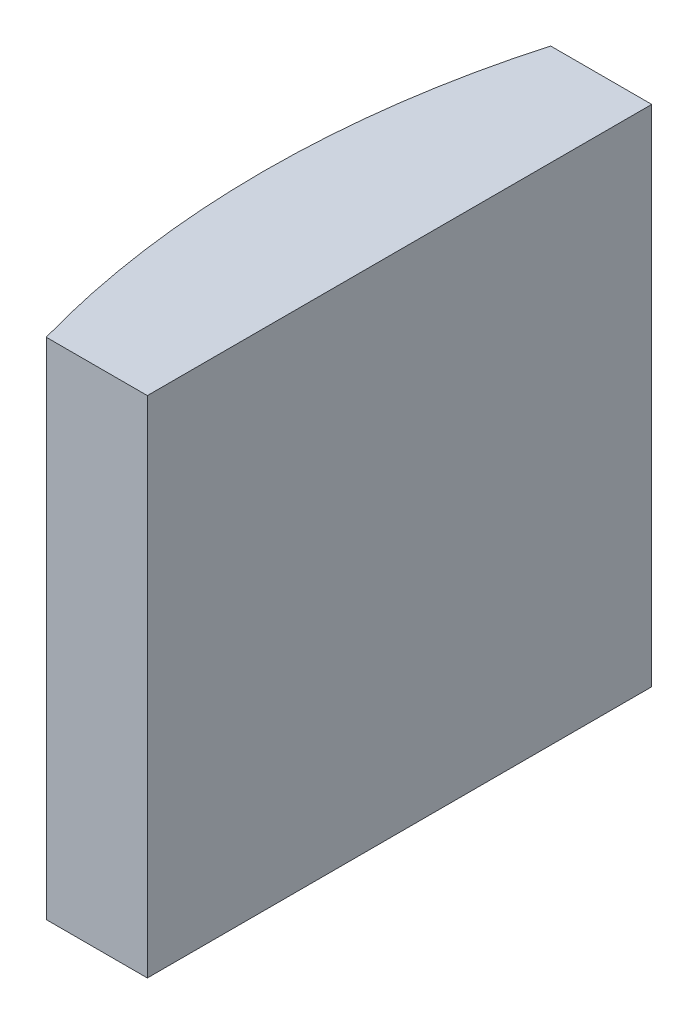
ISO-10303-21;
HEADER;
FILE_DESCRIPTION(('STEP AP214'),'2;1');
FILE_NAME('part.step','',(''),(''),'','','');
FILE_SCHEMA(('AUTOMOTIVE_DESIGN { 1 0 10303 214 1 1 1 1 }'));
ENDSEC;
DATA;
#1=APPLICATION_CONTEXT('core data for automotive mechanical design processes');
#2=APPLICATION_PROTOCOL_DEFINITION('international standard','automotive_design',2000,#1);
#3=PRODUCT_CONTEXT('',#1,'mechanical');
#4=PRODUCT('Part','Part','',(#3));
#5=PRODUCT_RELATED_PRODUCT_CATEGORY('part','',(#4));
#6=PRODUCT_DEFINITION_FORMATION('','',#4);
#7=PRODUCT_DEFINITION_CONTEXT('part definition',#1,'design');
#8=PRODUCT_DEFINITION('design','',#6,#7);
#9=PRODUCT_DEFINITION_SHAPE('','',#8);
#10=(LENGTH_UNIT() NAMED_UNIT(*) SI_UNIT(.MILLI.,.METRE.));
#11=(NAMED_UNIT(*) PLANE_ANGLE_UNIT() SI_UNIT($,.RADIAN.));
#12=(NAMED_UNIT(*) SI_UNIT($,.STERADIAN.) SOLID_ANGLE_UNIT());
#13=UNCERTAINTY_MEASURE_WITH_UNIT(LENGTH_MEASURE(1.E-05),#10,'distance_accuracy_value','');
#14=(GEOMETRIC_REPRESENTATION_CONTEXT(3) GLOBAL_UNCERTAINTY_ASSIGNED_CONTEXT((#13)) GLOBAL_UNIT_ASSIGNED_CONTEXT((#10,
#11,#12)) REPRESENTATION_CONTEXT('',''));
#15=CARTESIAN_POINT('',(0.,0.,0.));
#16=DIRECTION('',(0.,0.,1.));
#17=DIRECTION('',(1.,0.,0.));
#18=AXIS2_PLACEMENT_3D('',#15,#16,#17);
#19=CARTESIAN_POINT('',(4.35520433485127,10.,0.));
#20=DIRECTION('',(0.,-1.,0.));
#21=DIRECTION('',(0.,0.,-1.));
#22=AXIS2_PLACEMENT_3D('',#19,#20,#21);
#23=CYLINDRICAL_SURFACE('',#22,18.32);
#24=CARTESIAN_POINT('',(4.35520433485127,0.,0.));
#25=DIRECTION('',(0.,1.,0.));
#26=DIRECTION('',(0.,0.,1.));
#27=AXIS2_PLACEMENT_3D('',#24,#25,#26);
#28=CIRCLE('',#27,18.32);
#29=CARTESIAN_POINT('',(-13.2692786362886,0.,-5.));
#30=VERTEX_POINT('',#29);
#31=CARTESIAN_POINT('',(-13.2692786362886,0.,5.));
#32=VERTEX_POINT('',#31);
#33=EDGE_CURVE('E100',#30,#32,#28,.T.);
#34=ORIENTED_EDGE('',*,*,#33,.T.);
#35=DIRECTION('',(0.,-1.,0.));
#36=VECTOR('',#35,1.);
#37=CARTESIAN_POINT('',(-13.2692786362886,10.,5.));
#38=LINE('',#37,#36);
#39=CARTESIAN_POINT('',(-13.2692786362886,10.,5.));
#40=VERTEX_POINT('',#39);
#41=EDGE_CURVE('E11',#40,#32,#38,.T.);
#42=ORIENTED_EDGE('',*,*,#41,.F.);
#43=CARTESIAN_POINT('',(4.35520433485127,10.,0.));
#44=DIRECTION('',(0.,1.,0.));
#45=DIRECTION('',(0.,0.,1.));
#46=AXIS2_PLACEMENT_3D('',#43,#44,#45);
#47=CIRCLE('',#46,18.32);
#48=CARTESIAN_POINT('',(-13.2692786362886,10.,-5.));
#49=VERTEX_POINT('',#48);
#50=EDGE_CURVE('E88',#49,#40,#47,.T.);
#51=ORIENTED_EDGE('',*,*,#50,.F.);
#52=DIRECTION('',(0.,-1.,0.));
#53=VECTOR('',#52,1.);
#54=CARTESIAN_POINT('',(-13.2692786362886,10.,-5.));
#55=LINE('',#54,#53);
#56=EDGE_CURVE('E96',#49,#30,#55,.T.);
#57=ORIENTED_EDGE('',*,*,#56,.T.);
#58=EDGE_LOOP('',(#34,#42,#51,#57));
#59=FACE_BOUND('',#58,.T.);
#60=ADVANCED_FACE('F37',(#59),#23,.T.);
#61=CARTESIAN_POINT('',(-13.2692786362886,10.,5.));
#62=DIRECTION('',(0.,0.,-1.));
#63=DIRECTION('',(-1.,0.,0.));
#64=AXIS2_PLACEMENT_3D('',#61,#62,#63);
#65=PLANE('',#64);
#66=DIRECTION('',(1.,0.,0.));
#67=VECTOR('',#66,1.);
#68=CARTESIAN_POINT('',(-13.2692786362886,0.,5.));
#69=LINE('',#68,#67);
#70=CARTESIAN_POINT('',(-11.2647956651487,0.,5.));
#71=VERTEX_POINT('',#70);
#72=EDGE_CURVE('E92',#32,#71,#69,.T.);
#73=ORIENTED_EDGE('',*,*,#72,.T.);
#74=DIRECTION('',(0.,-1.,0.));
#75=VECTOR('',#74,1.);
#76=CARTESIAN_POINT('',(-11.2647956651487,10.,5.));
#77=LINE('',#76,#75);
#78=CARTESIAN_POINT('',(-11.2647956651487,10.,5.));
#79=VERTEX_POINT('',#78);
#80=EDGE_CURVE('E45',#79,#71,#77,.T.);
#81=ORIENTED_EDGE('',*,*,#80,.F.);
#82=DIRECTION('',(1.,0.,0.));
#83=VECTOR('',#82,1.);
#84=CARTESIAN_POINT('',(-13.2692786362886,10.,5.));
#85=LINE('',#84,#83);
#86=EDGE_CURVE('E83',#40,#79,#85,.T.);
#87=ORIENTED_EDGE('',*,*,#86,.F.);
#88=ORIENTED_EDGE('',*,*,#41,.T.);
#89=EDGE_LOOP('',(#73,#81,#87,#88));
#90=FACE_BOUND('',#89,.T.);
#91=ADVANCED_FACE('F91',(#90),#65,.F.);
#92=CARTESIAN_POINT('',(-11.2647956651487,10.,-5.));
#93=DIRECTION('',(-1.,0.,0.));
#94=DIRECTION('',(0.,0.,1.));
#95=AXIS2_PLACEMENT_3D('',#92,#93,#94);
#96=PLANE('',#95);
#97=DIRECTION('',(0.,0.,-1.));
#98=VECTOR('',#97,1.);
#99=CARTESIAN_POINT('',(-11.2647956651487,0.,-5.));
#100=LINE('',#99,#98);
#101=CARTESIAN_POINT('',(-11.2647956651487,0.,-5.));
#102=VERTEX_POINT('',#101);
#103=EDGE_CURVE('E70',#71,#102,#100,.T.);
#104=ORIENTED_EDGE('',*,*,#103,.T.);
#105=DIRECTION('',(0.,-1.,0.));
#106=VECTOR('',#105,1.);
#107=CARTESIAN_POINT('',(-11.2647956651487,10.,-5.));
#108=LINE('',#107,#106);
#109=CARTESIAN_POINT('',(-11.2647956651487,10.,-5.));
#110=VERTEX_POINT('',#109);
#111=EDGE_CURVE('E93',#110,#102,#108,.T.);
#112=ORIENTED_EDGE('',*,*,#111,.F.);
#113=DIRECTION('',(0.,0.,-1.));
#114=VECTOR('',#113,1.);
#115=CARTESIAN_POINT('',(-11.2647956651487,10.,-5.));
#116=LINE('',#115,#114);
#117=EDGE_CURVE('E86',#79,#110,#116,.T.);
#118=ORIENTED_EDGE('',*,*,#117,.F.);
#119=ORIENTED_EDGE('',*,*,#80,.T.);
#120=EDGE_LOOP('',(#104,#112,#118,#119));
#121=FACE_BOUND('',#120,.T.);
#122=ADVANCED_FACE('F94',(#121),#96,.F.);
#123=CARTESIAN_POINT('',(-13.2692786362886,10.,-5.));
#124=DIRECTION('',(0.,0.,1.));
#125=DIRECTION('',(1.,0.,0.));
#126=AXIS2_PLACEMENT_3D('',#123,#124,#125);
#127=PLANE('',#126);
#128=DIRECTION('',(-1.,0.,0.));
#129=VECTOR('',#128,1.);
#130=CARTESIAN_POINT('',(-13.2692786362886,0.,-5.));
#131=LINE('',#130,#129);
#132=EDGE_CURVE('E76',#102,#30,#131,.T.);
#133=ORIENTED_EDGE('',*,*,#132,.T.);
#134=ORIENTED_EDGE('',*,*,#56,.F.);
#135=DIRECTION('',(-1.,0.,0.));
#136=VECTOR('',#135,1.);
#137=CARTESIAN_POINT('',(-13.2692786362886,10.,-5.));
#138=LINE('',#137,#136);
#139=EDGE_CURVE('E53',#110,#49,#138,.T.);
#140=ORIENTED_EDGE('',*,*,#139,.F.);
#141=ORIENTED_EDGE('',*,*,#111,.T.);
#142=EDGE_LOOP('',(#133,#134,#140,#141));
#143=FACE_BOUND('',#142,.T.);
#144=ADVANCED_FACE('F107',(#143),#127,.F.);
#145=CARTESIAN_POINT('',(4.35520433485127,10.,0.));
#146=DIRECTION('',(0.,1.,0.));
#147=DIRECTION('',(0.,0.,1.));
#148=AXIS2_PLACEMENT_3D('',#145,#146,#147);
#149=PLANE('',#148);
#150=ORIENTED_EDGE('',*,*,#50,.T.);
#151=ORIENTED_EDGE('',*,*,#86,.T.);
#152=ORIENTED_EDGE('',*,*,#117,.T.);
#153=ORIENTED_EDGE('',*,*,#139,.T.);
#154=EDGE_LOOP('',(#150,#151,#152,#153));
#155=FACE_BOUND('',#154,.T.);
#156=ADVANCED_FACE('F84',(#155),#149,.T.);
#157=CARTESIAN_POINT('',(4.35520433485127,0.,0.));
#158=DIRECTION('',(0.,1.,0.));
#159=DIRECTION('',(0.,0.,1.));
#160=AXIS2_PLACEMENT_3D('',#157,#158,#159);
#161=PLANE('',#160);
#162=ORIENTED_EDGE('',*,*,#33,.F.);
#163=ORIENTED_EDGE('',*,*,#132,.F.);
#164=ORIENTED_EDGE('',*,*,#103,.F.);
#165=ORIENTED_EDGE('',*,*,#72,.F.);
#166=EDGE_LOOP('',(#162,#163,#164,#165));
#167=FACE_BOUND('',#166,.T.);
#168=ADVANCED_FACE('F110',(#167),#161,.F.);
#169=CLOSED_SHELL('',(#60,#91,#122,#144,#156,#168));
#170=MANIFOLD_SOLID_BREP('B2',#169);
#171=ADVANCED_BREP_SHAPE_REPRESENTATION('',(#18,#170),#14);
#172=SHAPE_DEFINITION_REPRESENTATION(#9,#171);
ENDSEC;
END-ISO-10303-21;
